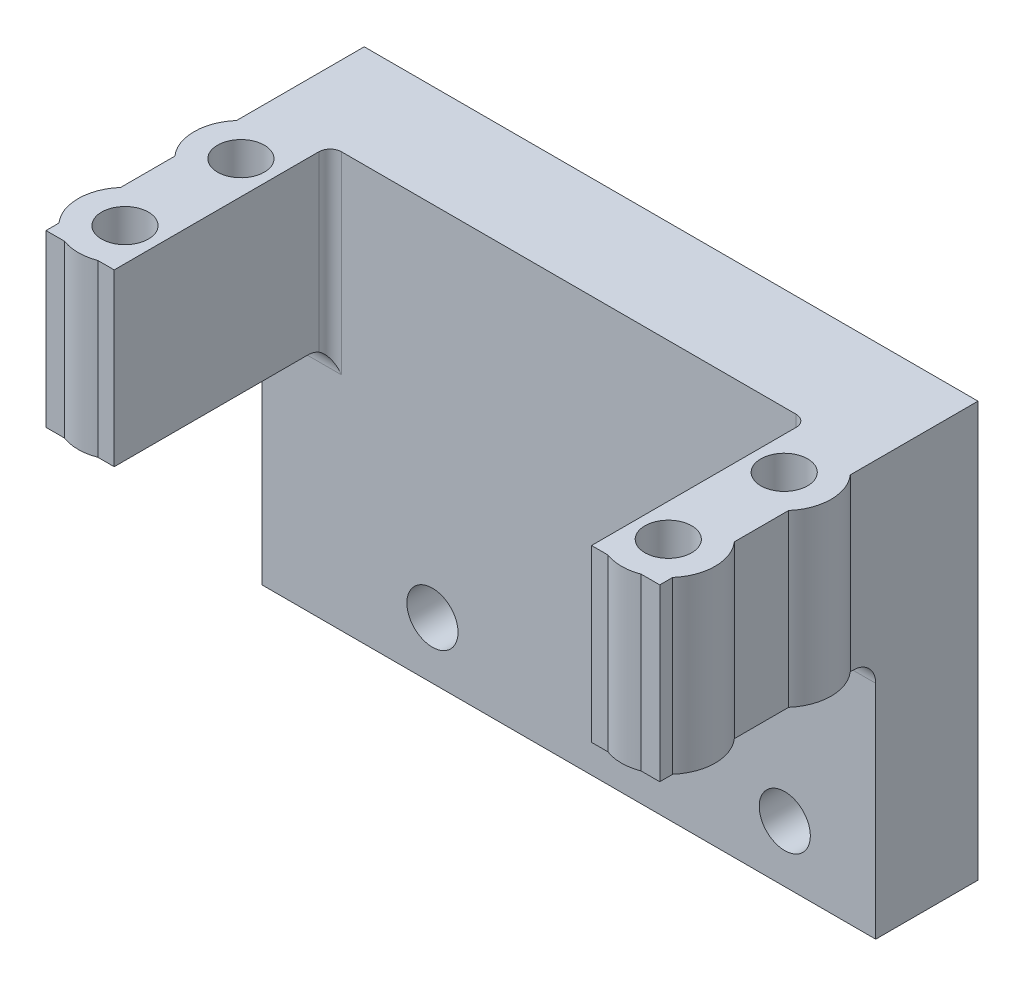
ISO-10303-21;
HEADER;
FILE_DESCRIPTION(('STEP AP214'),'2;1');
FILE_NAME('part.step','',(''),(''),'','','');
FILE_SCHEMA(('AUTOMOTIVE_DESIGN { 1 0 10303 214 1 1 1 1 }'));
ENDSEC;
DATA;
#1=APPLICATION_CONTEXT('core data for automotive mechanical design processes');
#2=APPLICATION_PROTOCOL_DEFINITION('international standard','automotive_design',2000,#1);
#3=PRODUCT_CONTEXT('',#1,'mechanical');
#4=PRODUCT('Part','Part','',(#3));
#5=PRODUCT_RELATED_PRODUCT_CATEGORY('part','',(#4));
#6=PRODUCT_DEFINITION_FORMATION('','',#4);
#7=PRODUCT_DEFINITION_CONTEXT('part definition',#1,'design');
#8=PRODUCT_DEFINITION('design','',#6,#7);
#9=PRODUCT_DEFINITION_SHAPE('','',#8);
#10=(LENGTH_UNIT() NAMED_UNIT(*) SI_UNIT(.MILLI.,.METRE.));
#11=(NAMED_UNIT(*) PLANE_ANGLE_UNIT() SI_UNIT($,.RADIAN.));
#12=(NAMED_UNIT(*) SI_UNIT($,.STERADIAN.) SOLID_ANGLE_UNIT());
#13=UNCERTAINTY_MEASURE_WITH_UNIT(LENGTH_MEASURE(1.E-05),#10,'distance_accuracy_value','');
#14=(GEOMETRIC_REPRESENTATION_CONTEXT(3) GLOBAL_UNCERTAINTY_ASSIGNED_CONTEXT((#13)) GLOBAL_UNIT_ASSIGNED_CONTEXT((#10,
#11,#12)) REPRESENTATION_CONTEXT('',''));
#15=CARTESIAN_POINT('',(0.,0.,0.));
#16=DIRECTION('',(0.,0.,1.));
#17=DIRECTION('',(1.,0.,0.));
#18=AXIS2_PLACEMENT_3D('',#15,#16,#17);
#19=CARTESIAN_POINT('',(-27.,13.25,9.));
#20=DIRECTION('',(1.,0.,0.));
#21=DIRECTION('',(0.,1.,0.));
#22=AXIS2_PLACEMENT_3D('',#19,#20,#21);
#23=PLANE('',#22);
#24=DIRECTION('',(0.,1.,0.));
#25=VECTOR('',#24,1.);
#26=CARTESIAN_POINT('',(-27.,-1.75000000000001,11.2357121559704));
#27=LINE('',#26,#25);
#28=CARTESIAN_POINT('',(-27.,13.25,11.2357121559704));
#29=VERTEX_POINT('',#28);
#30=CARTESIAN_POINT('',(-27.,-1.75000000000001,11.2357121559704));
#31=VERTEX_POINT('',#30);
#32=EDGE_CURVE('E227',#29,#31,#27,.F.);
#33=ORIENTED_EDGE('',*,*,#32,.F.);
#34=DIRECTION('',(0.,0.,-1.));
#35=VECTOR('',#34,1.);
#36=CARTESIAN_POINT('',(-27.,13.25,9.));
#37=LINE('',#36,#35);
#38=CARTESIAN_POINT('',(-27.,13.25,0.));
#39=VERTEX_POINT('',#38);
#40=EDGE_CURVE('E217',#29,#39,#37,.T.);
#41=ORIENTED_EDGE('',*,*,#40,.T.);
#42=DIRECTION('',(0.,-1.,0.));
#43=VECTOR('',#42,1.);
#44=CARTESIAN_POINT('',(-27.,13.25,0.));
#45=LINE('',#44,#43);
#46=CARTESIAN_POINT('',(-27.,-23.25,0.));
#47=VERTEX_POINT('',#46);
#48=EDGE_CURVE('E352',#39,#47,#45,.T.);
#49=ORIENTED_EDGE('',*,*,#48,.T.);
#50=DIRECTION('',(0.,0.,1.));
#51=VECTOR('',#50,1.);
#52=CARTESIAN_POINT('',(-27.,-23.25,0.));
#53=LINE('',#52,#51);
#54=CARTESIAN_POINT('',(-27.,-23.25,9.));
#55=VERTEX_POINT('',#54);
#56=EDGE_CURVE('E291',#47,#55,#53,.T.);
#57=ORIENTED_EDGE('',*,*,#56,.T.);
#58=DIRECTION('',(0.,-1.,0.));
#59=VECTOR('',#58,1.);
#60=CARTESIAN_POINT('',(-27.,13.25,9.));
#61=LINE('',#60,#59);
#62=CARTESIAN_POINT('',(-27.,-3.75000000000001,9.));
#63=VERTEX_POINT('',#62);
#64=EDGE_CURVE('E353',#63,#55,#61,.T.);
#65=ORIENTED_EDGE('',*,*,#64,.F.);
#66=CARTESIAN_POINT('',(-27.,-3.75000000000001,11.));
#67=DIRECTION('',(1.,0.,0.));
#68=DIRECTION('',(0.,1.,0.));
#69=AXIS2_PLACEMENT_3D('',#66,#67,#68);
#70=CIRCLE('',#69,2.);
#71=CARTESIAN_POINT('',(-27.,-1.75000000000001,11.));
#72=VERTEX_POINT('',#71);
#73=EDGE_CURVE('E405',#63,#72,#70,.T.);
#74=ORIENTED_EDGE('',*,*,#73,.T.);
#75=DIRECTION('',(0.,0.,-1.));
#76=VECTOR('',#75,1.);
#77=CARTESIAN_POINT('',(-27.,-1.75000000000001,28.));
#78=LINE('',#77,#76);
#79=EDGE_CURVE('E276',#31,#72,#78,.T.);
#80=ORIENTED_EDGE('',*,*,#79,.F.);
#81=EDGE_LOOP('',(#33,#41,#49,#57,#65,#74,#80));
#82=FACE_BOUND('',#81,.T.);
#83=ADVANCED_FACE('F32',(#82),#23,.F.);
#84=DIRECTION('',(0.,1.,0.));
#85=VECTOR('',#84,1.);
#86=CARTESIAN_POINT('',(-27.,-1.75000000000001,16.6631977616629));
#87=LINE('',#86,#85);
#88=CARTESIAN_POINT('',(-27.,-1.75000000000001,16.6631977616629));
#89=VERTEX_POINT('',#88);
#90=CARTESIAN_POINT('',(-27.,13.25,16.6631977616629));
#91=VERTEX_POINT('',#90);
#92=EDGE_CURVE('E209',#89,#91,#87,.T.);
#93=ORIENTED_EDGE('',*,*,#92,.F.);
#94=CARTESIAN_POINT('',(-27.,-1.75000000000001,21.4357121559704));
#95=VERTEX_POINT('',#94);
#96=EDGE_CURVE('E281',#95,#89,#78,.T.);
#97=ORIENTED_EDGE('',*,*,#96,.F.);
#98=DIRECTION('',(0.,1.,0.));
#99=VECTOR('',#98,1.);
#100=CARTESIAN_POINT('',(-27.,-1.75000000000001,21.4357121559704));
#101=LINE('',#100,#99);
#102=CARTESIAN_POINT('',(-27.,13.25,21.4357121559704));
#103=VERTEX_POINT('',#102);
#104=EDGE_CURVE('E212',#103,#95,#101,.F.);
#105=ORIENTED_EDGE('',*,*,#104,.F.);
#106=EDGE_CURVE('E206',#103,#91,#37,.T.);
#107=ORIENTED_EDGE('',*,*,#106,.T.);
#108=EDGE_LOOP('',(#93,#97,#105,#107));
#109=FACE_BOUND('',#108,.T.);
#110=ADVANCED_FACE('F208',(#109),#23,.F.);
#111=DIRECTION('',(0.,1.,0.));
#112=VECTOR('',#111,1.);
#113=CARTESIAN_POINT('',(-27.,-1.75000000000001,26.8631977616629));
#114=LINE('',#113,#112);
#115=CARTESIAN_POINT('',(-27.,-1.75000000000001,26.8631977616629));
#116=VERTEX_POINT('',#115);
#117=CARTESIAN_POINT('',(-27.,13.25,26.8631977616629));
#118=VERTEX_POINT('',#117);
#119=EDGE_CURVE('E245',#116,#118,#114,.T.);
#120=ORIENTED_EDGE('',*,*,#119,.F.);
#121=CARTESIAN_POINT('',(-27.,-1.75000000000001,28.));
#122=VERTEX_POINT('',#121);
#123=EDGE_CURVE('E277',#122,#116,#78,.T.);
#124=ORIENTED_EDGE('',*,*,#123,.F.);
#125=DIRECTION('',(0.,1.,0.));
#126=VECTOR('',#125,1.);
#127=CARTESIAN_POINT('',(-27.,13.25,28.));
#128=LINE('',#127,#126);
#129=CARTESIAN_POINT('',(-27.,13.25,28.));
#130=VERTEX_POINT('',#129);
#131=EDGE_CURVE('E256',#122,#130,#128,.T.);
#132=ORIENTED_EDGE('',*,*,#131,.T.);
#133=EDGE_CURVE('E216',#130,#118,#37,.T.);
#134=ORIENTED_EDGE('',*,*,#133,.T.);
#135=EDGE_LOOP('',(#120,#124,#132,#134));
#136=FACE_BOUND('',#135,.T.);
#137=ADVANCED_FACE('F484',(#136),#23,.F.);
#138=CARTESIAN_POINT('',(0.,0.,28.));
#139=DIRECTION('',(0.,0.,-1.));
#140=DIRECTION('',(1.,0.,0.));
#141=AXIS2_PLACEMENT_3D('',#138,#139,#140);
#142=PLANE('',#141);
#143=DIRECTION('',(0.,1.,0.));
#144=VECTOR('',#143,1.);
#145=CARTESIAN_POINT('',(-25.3655043110883,-1.75000000000001,28.));
#146=LINE('',#145,#144);
#147=CARTESIAN_POINT('',(-25.3655043110883,13.25,28.));
#148=VERTEX_POINT('',#147);
#149=CARTESIAN_POINT('',(-25.3655043110883,-1.75000000000001,28.));
#150=VERTEX_POINT('',#149);
#151=EDGE_CURVE('E392',#148,#150,#146,.F.);
#152=ORIENTED_EDGE('',*,*,#151,.F.);
#153=DIRECTION('',(1.,0.,0.));
#154=VECTOR('',#153,1.);
#155=CARTESIAN_POINT('',(-27.,13.25,28.));
#156=LINE('',#155,#154);
#157=EDGE_CURVE('E268',#130,#148,#156,.T.);
#158=ORIENTED_EDGE('',*,*,#157,.F.);
#159=ORIENTED_EDGE('',*,*,#131,.F.);
#160=DIRECTION('',(-1.,0.,0.));
#161=VECTOR('',#160,1.);
#162=CARTESIAN_POINT('',(-27.,-1.75000000000001,28.));
#163=LINE('',#162,#161);
#164=EDGE_CURVE('E259',#150,#122,#163,.T.);
#165=ORIENTED_EDGE('',*,*,#164,.F.);
#166=EDGE_LOOP('',(#152,#158,#159,#165));
#167=FACE_BOUND('',#166,.T.);
#168=ADVANCED_FACE('F480',(#167),#142,.F.);
#169=DIRECTION('',(0.,1.,0.));
#170=VECTOR('',#169,1.);
#171=CARTESIAN_POINT('',(-22.4344956889117,-1.75000000000001,28.));
#172=LINE('',#171,#170);
#173=CARTESIAN_POINT('',(-22.4344956889117,-1.75000000000001,28.));
#174=VERTEX_POINT('',#173);
#175=CARTESIAN_POINT('',(-22.4344956889117,13.25,28.));
#176=VERTEX_POINT('',#175);
#177=EDGE_CURVE('E381',#174,#176,#172,.T.);
#178=ORIENTED_EDGE('',*,*,#177,.F.);
#179=CARTESIAN_POINT('',(-21.,-1.75000000000001,28.));
#180=VERTEX_POINT('',#179);
#181=EDGE_CURVE('E261',#180,#174,#163,.T.);
#182=ORIENTED_EDGE('',*,*,#181,.F.);
#183=DIRECTION('',(0.,-1.,0.));
#184=VECTOR('',#183,1.);
#185=CARTESIAN_POINT('',(-21.,13.25,28.));
#186=LINE('',#185,#184);
#187=CARTESIAN_POINT('',(-21.,13.25,28.));
#188=VERTEX_POINT('',#187);
#189=EDGE_CURVE('E264',#188,#180,#186,.T.);
#190=ORIENTED_EDGE('',*,*,#189,.F.);
#191=EDGE_CURVE('E267',#176,#188,#156,.T.);
#192=ORIENTED_EDGE('',*,*,#191,.F.);
#193=EDGE_LOOP('',(#178,#182,#190,#192));
#194=FACE_BOUND('',#193,.T.);
#195=ADVANCED_FACE('F472',(#194),#142,.F.);
#196=CARTESIAN_POINT('',(27.,13.25,9.));
#197=DIRECTION('',(-1.,0.,0.));
#198=DIRECTION('',(0.,-1.,0.));
#199=AXIS2_PLACEMENT_3D('',#196,#197,#198);
#200=PLANE('',#199);
#201=DIRECTION('',(0.,0.,-1.));
#202=VECTOR('',#201,1.);
#203=CARTESIAN_POINT('',(27.,-1.75,28.));
#204=LINE('',#203,#202);
#205=CARTESIAN_POINT('',(27.,-1.75,21.4357121559704));
#206=VERTEX_POINT('',#205);
#207=CARTESIAN_POINT('',(27.,-1.75,16.6631977616629));
#208=VERTEX_POINT('',#207);
#209=EDGE_CURVE('E347',#206,#208,#204,.T.);
#210=ORIENTED_EDGE('',*,*,#209,.T.);
#211=DIRECTION('',(0.,1.,0.));
#212=VECTOR('',#211,1.);
#213=CARTESIAN_POINT('',(27.,-1.75,16.6631977616629));
#214=LINE('',#213,#212);
#215=CARTESIAN_POINT('',(27.,13.25,16.6631977616629));
#216=VERTEX_POINT('',#215);
#217=EDGE_CURVE('E308',#208,#216,#214,.T.);
#218=ORIENTED_EDGE('',*,*,#217,.T.);
#219=DIRECTION('',(0.,0.,-1.));
#220=VECTOR('',#219,1.);
#221=CARTESIAN_POINT('',(27.,13.25,9.));
#222=LINE('',#221,#220);
#223=CARTESIAN_POINT('',(27.,13.25,21.4357121559704));
#224=VERTEX_POINT('',#223);
#225=EDGE_CURVE('E372',#224,#216,#222,.T.);
#226=ORIENTED_EDGE('',*,*,#225,.F.);
#227=DIRECTION('',(0.,1.,0.));
#228=VECTOR('',#227,1.);
#229=CARTESIAN_POINT('',(27.,-1.75,21.4357121559704));
#230=LINE('',#229,#228);
#231=EDGE_CURVE('E317',#224,#206,#230,.F.);
#232=ORIENTED_EDGE('',*,*,#231,.T.);
#233=EDGE_LOOP('',(#210,#218,#226,#232));
#234=FACE_BOUND('',#233,.T.);
#235=ADVANCED_FACE('F512',(#234),#200,.F.);
#236=CARTESIAN_POINT('',(27.,-1.75,28.));
#237=VERTEX_POINT('',#236);
#238=CARTESIAN_POINT('',(27.,-1.75,26.8631977616629));
#239=VERTEX_POINT('',#238);
#240=EDGE_CURVE('E343',#237,#239,#204,.T.);
#241=ORIENTED_EDGE('',*,*,#240,.T.);
#242=DIRECTION('',(0.,1.,0.));
#243=VECTOR('',#242,1.);
#244=CARTESIAN_POINT('',(27.,-1.75,26.8631977616629));
#245=LINE('',#244,#243);
#246=CARTESIAN_POINT('',(27.,13.25,26.8631977616629));
#247=VERTEX_POINT('',#246);
#248=EDGE_CURVE('E320',#239,#247,#245,.T.);
#249=ORIENTED_EDGE('',*,*,#248,.T.);
#250=CARTESIAN_POINT('',(27.,13.25,28.));
#251=VERTEX_POINT('',#250);
#252=EDGE_CURVE('E368',#251,#247,#222,.T.);
#253=ORIENTED_EDGE('',*,*,#252,.F.);
#254=DIRECTION('',(0.,1.,0.));
#255=VECTOR('',#254,1.);
#256=CARTESIAN_POINT('',(27.,13.25,28.));
#257=LINE('',#256,#255);
#258=EDGE_CURVE('E330',#237,#251,#257,.T.);
#259=ORIENTED_EDGE('',*,*,#258,.F.);
#260=EDGE_LOOP('',(#241,#249,#253,#259));
#261=FACE_BOUND('',#260,.T.);
#262=ADVANCED_FACE('F524',(#261),#200,.F.);
#263=CARTESIAN_POINT('',(0.,0.,28.));
#264=DIRECTION('',(0.,0.,-1.));
#265=DIRECTION('',(-1.,0.,0.));
#266=AXIS2_PLACEMENT_3D('',#263,#264,#265);
#267=PLANE('',#266);
#268=DIRECTION('',(1.,0.,0.));
#269=VECTOR('',#268,1.);
#270=CARTESIAN_POINT('',(27.,-1.75,28.));
#271=LINE('',#270,#269);
#272=CARTESIAN_POINT('',(21.,-1.75,28.));
#273=VERTEX_POINT('',#272);
#274=CARTESIAN_POINT('',(22.4344956889117,-1.75,28.));
#275=VERTEX_POINT('',#274);
#276=EDGE_CURVE('E340',#273,#275,#271,.T.);
#277=ORIENTED_EDGE('',*,*,#276,.T.);
#278=DIRECTION('',(0.,1.,0.));
#279=VECTOR('',#278,1.);
#280=CARTESIAN_POINT('',(22.4344956889117,-1.75,28.));
#281=LINE('',#280,#279);
#282=CARTESIAN_POINT('',(22.4344956889117,13.25,28.));
#283=VERTEX_POINT('',#282);
#284=EDGE_CURVE('E378',#275,#283,#281,.T.);
#285=ORIENTED_EDGE('',*,*,#284,.T.);
#286=DIRECTION('',(-1.,0.,0.));
#287=VECTOR('',#286,1.);
#288=CARTESIAN_POINT('',(27.,13.25,28.));
#289=LINE('',#288,#287);
#290=CARTESIAN_POINT('',(21.,13.25,28.));
#291=VERTEX_POINT('',#290);
#292=EDGE_CURVE('E333',#283,#291,#289,.T.);
#293=ORIENTED_EDGE('',*,*,#292,.T.);
#294=DIRECTION('',(0.,-1.,0.));
#295=VECTOR('',#294,1.);
#296=CARTESIAN_POINT('',(21.,13.25,28.));
#297=LINE('',#296,#295);
#298=EDGE_CURVE('E337',#291,#273,#297,.T.);
#299=ORIENTED_EDGE('',*,*,#298,.T.);
#300=EDGE_LOOP('',(#277,#285,#293,#299));
#301=FACE_BOUND('',#300,.T.);
#302=ADVANCED_FACE('F537',(#301),#267,.F.);
#303=CARTESIAN_POINT('',(27.,-1.75,11.2357121559704));
#304=VERTEX_POINT('',#303);
#305=CARTESIAN_POINT('',(27.,-1.75,11.));
#306=VERTEX_POINT('',#305);
#307=EDGE_CURVE('E342',#304,#306,#204,.T.);
#308=ORIENTED_EDGE('',*,*,#307,.T.);
#309=CARTESIAN_POINT('',(27.,-3.75,11.));
#310=DIRECTION('',(-1.,0.,0.));
#311=DIRECTION('',(0.,-1.,0.));
#312=AXIS2_PLACEMENT_3D('',#309,#310,#311);
#313=CIRCLE('',#312,2.);
#314=CARTESIAN_POINT('',(27.,-3.75,9.));
#315=VERTEX_POINT('',#314);
#316=EDGE_CURVE('E410',#306,#315,#313,.T.);
#317=ORIENTED_EDGE('',*,*,#316,.T.);
#318=DIRECTION('',(0.,1.,0.));
#319=VECTOR('',#318,1.);
#320=CARTESIAN_POINT('',(27.,13.25,9.));
#321=LINE('',#320,#319);
#322=CARTESIAN_POINT('',(27.,-23.25,9.));
#323=VERTEX_POINT('',#322);
#324=EDGE_CURVE('E355',#323,#315,#321,.T.);
#325=ORIENTED_EDGE('',*,*,#324,.F.);
#326=DIRECTION('',(0.,0.,1.));
#327=VECTOR('',#326,1.);
#328=CARTESIAN_POINT('',(27.,-23.25,0.));
#329=LINE('',#328,#327);
#330=CARTESIAN_POINT('',(27.,-23.25,0.));
#331=VERTEX_POINT('',#330);
#332=EDGE_CURVE('E296',#331,#323,#329,.T.);
#333=ORIENTED_EDGE('',*,*,#332,.F.);
#334=DIRECTION('',(0.,1.,0.));
#335=VECTOR('',#334,1.);
#336=CARTESIAN_POINT('',(27.,13.25,0.));
#337=LINE('',#336,#335);
#338=CARTESIAN_POINT('',(27.,13.25,0.));
#339=VERTEX_POINT('',#338);
#340=EDGE_CURVE('E363',#331,#339,#337,.T.);
#341=ORIENTED_EDGE('',*,*,#340,.T.);
#342=CARTESIAN_POINT('',(27.,13.25,11.2357121559704));
#343=VERTEX_POINT('',#342);
#344=EDGE_CURVE('E367',#343,#339,#222,.T.);
#345=ORIENTED_EDGE('',*,*,#344,.F.);
#346=DIRECTION('',(0.,1.,0.));
#347=VECTOR('',#346,1.);
#348=CARTESIAN_POINT('',(27.,-1.75,11.2357121559704));
#349=LINE('',#348,#347);
#350=EDGE_CURVE('E304',#343,#304,#349,.F.);
#351=ORIENTED_EDGE('',*,*,#350,.T.);
#352=EDGE_LOOP('',(#308,#317,#325,#333,#341,#345,#351));
#353=FACE_BOUND('',#352,.T.);
#354=ADVANCED_FACE('F506',(#353),#200,.F.);
#355=CARTESIAN_POINT('',(-27.,13.25,9.));
#356=DIRECTION('',(0.,-1.,0.));
#357=DIRECTION('',(1.,0.,0.));
#358=AXIS2_PLACEMENT_3D('',#355,#356,#357);
#359=PLANE('',#358);
#360=DIRECTION('',(0.,0.,-1.));
#361=VECTOR('',#360,1.);
#362=CARTESIAN_POINT('',(-21.,13.25,28.));
#363=LINE('',#362,#361);
#364=CARTESIAN_POINT('',(-21.,13.25,10.));
#365=VERTEX_POINT('',#364);
#366=EDGE_CURVE('E271',#188,#365,#363,.T.);
#367=ORIENTED_EDGE('',*,*,#366,.T.);
#368=CARTESIAN_POINT('',(-20.,13.25,10.));
#369=DIRECTION('',(0.,-1.,0.));
#370=DIRECTION('',(1.,0.,0.));
#371=AXIS2_PLACEMENT_3D('',#368,#369,#370);
#372=CIRCLE('',#371,1.);
#373=CARTESIAN_POINT('',(-20.,13.25,9.));
#374=VERTEX_POINT('',#373);
#375=EDGE_CURVE('E430',#365,#374,#372,.T.);
#376=ORIENTED_EDGE('',*,*,#375,.T.);
#377=DIRECTION('',(-1.,0.,0.));
#378=VECTOR('',#377,1.);
#379=CARTESIAN_POINT('',(-27.,13.25,9.));
#380=LINE('',#379,#378);
#381=CARTESIAN_POINT('',(20.,13.25,9.));
#382=VERTEX_POINT('',#381);
#383=EDGE_CURVE('E359',#382,#374,#380,.T.);
#384=ORIENTED_EDGE('',*,*,#383,.F.);
#385=CARTESIAN_POINT('',(20.,13.25,10.));
#386=DIRECTION('',(0.,-1.,0.));
#387=DIRECTION('',(1.,0.,0.));
#388=AXIS2_PLACEMENT_3D('',#385,#386,#387);
#389=CIRCLE('',#388,1.);
#390=CARTESIAN_POINT('',(21.,13.25,10.));
#391=VERTEX_POINT('',#390);
#392=EDGE_CURVE('E11',#382,#391,#389,.T.);
#393=ORIENTED_EDGE('',*,*,#392,.T.);
#394=DIRECTION('',(0.,0.,-1.));
#395=VECTOR('',#394,1.);
#396=CARTESIAN_POINT('',(21.,13.25,28.));
#397=LINE('',#396,#395);
#398=EDGE_CURVE('E350',#291,#391,#397,.T.);
#399=ORIENTED_EDGE('',*,*,#398,.F.);
#400=ORIENTED_EDGE('',*,*,#292,.F.);
#401=CARTESIAN_POINT('',(23.9,13.25,24.1494549588167));
#402=DIRECTION('',(0.,1.,0.));
#403=DIRECTION('',(-1.,0.,0.));
#404=AXIS2_PLACEMENT_3D('',#401,#402,#403);
#405=CIRCLE('',#404,4.12);
#406=CARTESIAN_POINT('',(25.3655043110883,13.25,28.));
#407=VERTEX_POINT('',#406);
#408=EDGE_CURVE('E315',#283,#407,#405,.T.);
#409=ORIENTED_EDGE('',*,*,#408,.T.);
#410=EDGE_CURVE('E335',#251,#407,#289,.T.);
#411=ORIENTED_EDGE('',*,*,#410,.F.);
#412=ORIENTED_EDGE('',*,*,#252,.T.);
#413=EDGE_CURVE('E311',#247,#224,#405,.T.);
#414=ORIENTED_EDGE('',*,*,#413,.T.);
#415=ORIENTED_EDGE('',*,*,#225,.T.);
#416=CARTESIAN_POINT('',(23.9,13.25,13.9494549588167));
#417=DIRECTION('',(0.,1.,0.));
#418=DIRECTION('',(-1.,0.,0.));
#419=AXIS2_PLACEMENT_3D('',#416,#417,#418);
#420=CIRCLE('',#419,4.12);
#421=EDGE_CURVE('E299',#216,#343,#420,.T.);
#422=ORIENTED_EDGE('',*,*,#421,.T.);
#423=ORIENTED_EDGE('',*,*,#344,.T.);
#424=DIRECTION('',(-1.,0.,0.));
#425=VECTOR('',#424,1.);
#426=CARTESIAN_POINT('',(-27.,13.25,0.));
#427=LINE('',#426,#425);
#428=EDGE_CURVE('E356',#339,#39,#427,.T.);
#429=ORIENTED_EDGE('',*,*,#428,.T.);
#430=ORIENTED_EDGE('',*,*,#40,.F.);
#431=CARTESIAN_POINT('',(-23.9,13.25,13.9494549588167));
#432=DIRECTION('',(0.,-1.,0.));
#433=DIRECTION('',(1.,0.,0.));
#434=AXIS2_PLACEMENT_3D('',#431,#432,#433);
#435=CIRCLE('',#434,4.12);
#436=EDGE_CURVE('E224',#91,#29,#435,.T.);
#437=ORIENTED_EDGE('',*,*,#436,.F.);
#438=ORIENTED_EDGE('',*,*,#106,.F.);
#439=CARTESIAN_POINT('',(-23.9,13.25,24.1494549588167));
#440=DIRECTION('',(0.,-1.,0.));
#441=DIRECTION('',(1.,0.,0.));
#442=AXIS2_PLACEMENT_3D('',#439,#440,#441);
#443=CIRCLE('',#442,4.12);
#444=EDGE_CURVE('E238',#118,#103,#443,.T.);
#445=ORIENTED_EDGE('',*,*,#444,.F.);
#446=ORIENTED_EDGE('',*,*,#133,.F.);
#447=ORIENTED_EDGE('',*,*,#157,.T.);
#448=EDGE_CURVE('E243',#176,#148,#443,.T.);
#449=ORIENTED_EDGE('',*,*,#448,.F.);
#450=ORIENTED_EDGE('',*,*,#191,.T.);
#451=EDGE_LOOP('',(#367,#376,#384,#393,#399,#400,#409,#411,#412,#414,#415,#422,#423,#429,#430,
#437,#438,#445,#446,#447,#449,#450));
#452=FACE_BOUND('',#451,.T.);
#453=CARTESIAN_POINT('',(-23.9,13.25,13.9494549588167));
#454=DIRECTION('',(0.,-1.,0.));
#455=DIRECTION('',(1.,0.,0.));
#456=AXIS2_PLACEMENT_3D('',#453,#454,#455);
#457=CIRCLE('',#456,2.06);
#458=CARTESIAN_POINT('',(-21.84,13.25,13.9494549588167));
#459=VERTEX_POINT('',#458);
#460=EDGE_CURVE('E250',#459,#459,#457,.T.);
#461=ORIENTED_EDGE('',*,*,#460,.T.);
#462=EDGE_LOOP('',(#461));
#463=FACE_BOUND('',#462,.T.);
#464=CARTESIAN_POINT('',(-23.9,13.25,24.1494549588167));
#465=DIRECTION('',(0.,-1.,0.));
#466=DIRECTION('',(1.,0.,0.));
#467=AXIS2_PLACEMENT_3D('',#464,#465,#466);
#468=CIRCLE('',#467,2.06);
#469=CARTESIAN_POINT('',(-21.84,13.25,24.1494549588167));
#470=VERTEX_POINT('',#469);
#471=EDGE_CURVE('E249',#470,#470,#468,.T.);
#472=ORIENTED_EDGE('',*,*,#471,.T.);
#473=EDGE_LOOP('',(#472));
#474=FACE_BOUND('',#473,.T.);
#475=CARTESIAN_POINT('',(23.9,13.25,13.9494549588167));
#476=DIRECTION('',(0.,1.,0.));
#477=DIRECTION('',(-1.,0.,0.));
#478=AXIS2_PLACEMENT_3D('',#475,#476,#477);
#479=CIRCLE('',#478,2.06);
#480=CARTESIAN_POINT('',(21.84,13.25,13.9494549588167));
#481=VERTEX_POINT('',#480);
#482=EDGE_CURVE('E324',#481,#481,#479,.T.);
#483=ORIENTED_EDGE('',*,*,#482,.F.);
#484=EDGE_LOOP('',(#483));
#485=FACE_BOUND('',#484,.T.);
#486=CARTESIAN_POINT('',(23.9,13.25,24.1494549588167));
#487=DIRECTION('',(0.,1.,0.));
#488=DIRECTION('',(-1.,0.,0.));
#489=AXIS2_PLACEMENT_3D('',#486,#487,#488);
#490=CIRCLE('',#489,2.06);
#491=CARTESIAN_POINT('',(21.84,13.25,24.1494549588167));
#492=VERTEX_POINT('',#491);
#493=EDGE_CURVE('E323',#492,#492,#490,.T.);
#494=ORIENTED_EDGE('',*,*,#493,.F.);
#495=EDGE_LOOP('',(#494));
#496=FACE_BOUND('',#495,.T.);
#497=ADVANCED_FACE('F231',(#452,#463,#474,#485,#496),#359,.F.);
#498=CARTESIAN_POINT('',(0.,0.,9.));
#499=DIRECTION('',(0.,0.,1.));
#500=DIRECTION('',(1.,0.,0.));
#501=AXIS2_PLACEMENT_3D('',#498,#499,#500);
#502=PLANE('',#501);
#503=ORIENTED_EDGE('',*,*,#383,.T.);
#504=DIRECTION('',(0.,-1.,0.));
#505=VECTOR('',#504,1.);
#506=CARTESIAN_POINT('',(-20.,-3.75000000000001,9.));
#507=LINE('',#506,#505);
#508=CARTESIAN_POINT('',(-20.,-3.75000000000001,9.));
#509=VERTEX_POINT('',#508);
#510=EDGE_CURVE('E416',#374,#509,#507,.T.);
#511=ORIENTED_EDGE('',*,*,#510,.T.);
#512=DIRECTION('',(-1.,0.,0.));
#513=VECTOR('',#512,1.);
#514=CARTESIAN_POINT('',(-27.,-3.75000000000001,9.));
#515=LINE('',#514,#513);
#516=EDGE_CURVE('E397',#509,#63,#515,.T.);
#517=ORIENTED_EDGE('',*,*,#516,.T.);
#518=ORIENTED_EDGE('',*,*,#64,.T.);
#519=DIRECTION('',(1.,0.,0.));
#520=VECTOR('',#519,1.);
#521=CARTESIAN_POINT('',(-27.,-23.25,9.));
#522=LINE('',#521,#520);
#523=EDGE_CURVE('E292',#55,#323,#522,.T.);
#524=ORIENTED_EDGE('',*,*,#523,.T.);
#525=ORIENTED_EDGE('',*,*,#324,.T.);
#526=DIRECTION('',(1.,0.,0.));
#527=VECTOR('',#526,1.);
#528=CARTESIAN_POINT('',(0.,-3.75000000000001,9.));
#529=LINE('',#528,#527);
#530=CARTESIAN_POINT('',(20.,-3.75,9.));
#531=VERTEX_POINT('',#530);
#532=EDGE_CURVE('E395',#315,#531,#529,.F.);
#533=ORIENTED_EDGE('',*,*,#532,.T.);
#534=DIRECTION('',(0.,-1.,0.));
#535=VECTOR('',#534,1.);
#536=CARTESIAN_POINT('',(20.,0.,9.));
#537=LINE('',#536,#535);
#538=EDGE_CURVE('E414',#531,#382,#537,.F.);
#539=ORIENTED_EDGE('',*,*,#538,.T.);
#540=EDGE_LOOP('',(#503,#511,#517,#518,#524,#525,#533,#539));
#541=FACE_BOUND('',#540,.T.);
#542=CARTESIAN_POINT('',(19.,-18.25,9.));
#543=DIRECTION('',(0.,0.,1.));
#544=DIRECTION('',(1.,0.,0.));
#545=AXIS2_PLACEMENT_3D('',#542,#543,#544);
#546=CIRCLE('',#545,2.25);
#547=CARTESIAN_POINT('',(21.25,-18.25,9.));
#548=VERTEX_POINT('',#547);
#549=EDGE_CURVE('E282',#548,#548,#546,.T.);
#550=ORIENTED_EDGE('',*,*,#549,.F.);
#551=EDGE_LOOP('',(#550));
#552=FACE_BOUND('',#551,.T.);
#553=CARTESIAN_POINT('',(-12.,-18.25,9.));
#554=DIRECTION('',(0.,0.,1.));
#555=DIRECTION('',(1.,0.,0.));
#556=AXIS2_PLACEMENT_3D('',#553,#554,#555);
#557=CIRCLE('',#556,2.25);
#558=CARTESIAN_POINT('',(-9.75,-18.25,9.));
#559=VERTEX_POINT('',#558);
#560=EDGE_CURVE('E280',#559,#559,#557,.T.);
#561=ORIENTED_EDGE('',*,*,#560,.F.);
#562=EDGE_LOOP('',(#561));
#563=FACE_BOUND('',#562,.T.);
#564=ADVANCED_FACE('F456',(#541,#552,#563),#502,.T.);
#565=CARTESIAN_POINT('',(0.,0.,0.));
#566=DIRECTION('',(0.,0.,1.));
#567=DIRECTION('',(1.,0.,0.));
#568=AXIS2_PLACEMENT_3D('',#565,#566,#567);
#569=PLANE('',#568);
#570=CARTESIAN_POINT('',(19.,-18.25,0.));
#571=DIRECTION('',(0.,0.,1.));
#572=DIRECTION('',(1.,0.,0.));
#573=AXIS2_PLACEMENT_3D('',#570,#571,#572);
#574=CIRCLE('',#573,2.25);
#575=CARTESIAN_POINT('',(21.25,-18.25,0.));
#576=VERTEX_POINT('',#575);
#577=EDGE_CURVE('E295',#576,#576,#574,.T.);
#578=ORIENTED_EDGE('',*,*,#577,.T.);
#579=EDGE_LOOP('',(#578));
#580=FACE_BOUND('',#579,.T.);
#581=CARTESIAN_POINT('',(-12.,-18.25,0.));
#582=DIRECTION('',(0.,0.,1.));
#583=DIRECTION('',(1.,0.,0.));
#584=AXIS2_PLACEMENT_3D('',#581,#582,#583);
#585=CIRCLE('',#584,2.25);
#586=CARTESIAN_POINT('',(-9.75,-18.25,0.));
#587=VERTEX_POINT('',#586);
#588=EDGE_CURVE('E285',#587,#587,#585,.T.);
#589=ORIENTED_EDGE('',*,*,#588,.T.);
#590=EDGE_LOOP('',(#589));
#591=FACE_BOUND('',#590,.T.);
#592=DIRECTION('',(1.,0.,0.));
#593=VECTOR('',#592,1.);
#594=CARTESIAN_POINT('',(-27.,-23.25,0.));
#595=LINE('',#594,#593);
#596=EDGE_CURVE('E288',#47,#331,#595,.T.);
#597=ORIENTED_EDGE('',*,*,#596,.F.);
#598=ORIENTED_EDGE('',*,*,#48,.F.);
#599=ORIENTED_EDGE('',*,*,#428,.F.);
#600=ORIENTED_EDGE('',*,*,#340,.F.);
#601=EDGE_LOOP('',(#597,#598,#599,#600));
#602=FACE_BOUND('',#601,.T.);
#603=ADVANCED_FACE('F594',(#580,#591,#602),#569,.F.);
#604=CARTESIAN_POINT('',(21.,13.25,28.));
#605=DIRECTION('',(1.,0.,0.));
#606=DIRECTION('',(0.,0.,-1.));
#607=AXIS2_PLACEMENT_3D('',#604,#605,#606);
#608=PLANE('',#607);
#609=ORIENTED_EDGE('',*,*,#398,.T.);
#610=DIRECTION('',(0.,-1.,0.));
#611=VECTOR('',#610,1.);
#612=CARTESIAN_POINT('',(21.,13.25,10.));
#613=LINE('',#612,#611);
#614=CARTESIAN_POINT('',(21.,-2.01794919243113,10.));
#615=VERTEX_POINT('',#614);
#616=EDGE_CURVE('E421',#391,#615,#613,.T.);
#617=ORIENTED_EDGE('',*,*,#616,.T.);
#618=CARTESIAN_POINT('',(21.,-3.75,11.));
#619=DIRECTION('',(1.,0.,0.));
#620=DIRECTION('',(0.,0.,-1.));
#621=AXIS2_PLACEMENT_3D('',#618,#619,#620);
#622=CIRCLE('',#621,2.);
#623=CARTESIAN_POINT('',(21.,-1.75,11.));
#624=VERTEX_POINT('',#623);
#625=EDGE_CURVE('E412',#615,#624,#622,.T.);
#626=ORIENTED_EDGE('',*,*,#625,.T.);
#627=DIRECTION('',(0.,0.,-1.));
#628=VECTOR('',#627,1.);
#629=CARTESIAN_POINT('',(21.,-1.75,28.));
#630=LINE('',#629,#628);
#631=EDGE_CURVE('E346',#273,#624,#630,.T.);
#632=ORIENTED_EDGE('',*,*,#631,.F.);
#633=ORIENTED_EDGE('',*,*,#298,.F.);
#634=EDGE_LOOP('',(#609,#617,#626,#632,#633));
#635=FACE_BOUND('',#634,.T.);
#636=ADVANCED_FACE('F540',(#635),#608,.F.);
#637=CARTESIAN_POINT('',(27.,-1.75,28.));
#638=DIRECTION('',(0.,1.,0.));
#639=DIRECTION('',(-1.,0.,0.));
#640=AXIS2_PLACEMENT_3D('',#637,#638,#639);
#641=PLANE('',#640);
#642=ORIENTED_EDGE('',*,*,#631,.T.);
#643=DIRECTION('',(1.,0.,0.));
#644=VECTOR('',#643,1.);
#645=CARTESIAN_POINT('',(27.,-1.75,11.));
#646=LINE('',#645,#644);
#647=EDGE_CURVE('E402',#624,#306,#646,.T.);
#648=ORIENTED_EDGE('',*,*,#647,.T.);
#649=ORIENTED_EDGE('',*,*,#307,.F.);
#650=CARTESIAN_POINT('',(23.9,-1.75,13.9494549588167));
#651=DIRECTION('',(0.,1.,0.));
#652=DIRECTION('',(-1.,0.,0.));
#653=AXIS2_PLACEMENT_3D('',#650,#651,#652);
#654=CIRCLE('',#653,4.12);
#655=EDGE_CURVE('E302',#208,#304,#654,.T.);
#656=ORIENTED_EDGE('',*,*,#655,.F.);
#657=ORIENTED_EDGE('',*,*,#209,.F.);
#658=CARTESIAN_POINT('',(23.9,-1.75,24.1494549588167));
#659=DIRECTION('',(0.,1.,0.));
#660=DIRECTION('',(-1.,0.,0.));
#661=AXIS2_PLACEMENT_3D('',#658,#659,#660);
#662=CIRCLE('',#661,4.12);
#663=EDGE_CURVE('E312',#239,#206,#662,.T.);
#664=ORIENTED_EDGE('',*,*,#663,.F.);
#665=ORIENTED_EDGE('',*,*,#240,.F.);
#666=CARTESIAN_POINT('',(25.3655043110883,-1.75,28.));
#667=VERTEX_POINT('',#666);
#668=EDGE_CURVE('E339',#667,#237,#271,.T.);
#669=ORIENTED_EDGE('',*,*,#668,.F.);
#670=EDGE_CURVE('E314',#275,#667,#662,.T.);
#671=ORIENTED_EDGE('',*,*,#670,.F.);
#672=ORIENTED_EDGE('',*,*,#276,.F.);
#673=EDGE_LOOP('',(#642,#648,#649,#656,#657,#664,#665,#669,#671,#672));
#674=FACE_BOUND('',#673,.T.);
#675=CARTESIAN_POINT('',(23.9,-1.75,13.9494549588167));
#676=DIRECTION('',(0.,1.,0.));
#677=DIRECTION('',(-1.,0.,0.));
#678=AXIS2_PLACEMENT_3D('',#675,#676,#677);
#679=CIRCLE('',#678,2.06);
#680=CARTESIAN_POINT('',(21.84,-1.75,13.9494549588167));
#681=VERTEX_POINT('',#680);
#682=EDGE_CURVE('E334',#681,#681,#679,.T.);
#683=ORIENTED_EDGE('',*,*,#682,.T.);
#684=EDGE_LOOP('',(#683));
#685=FACE_BOUND('',#684,.T.);
#686=CARTESIAN_POINT('',(23.9,-1.75,24.1494549588167));
#687=DIRECTION('',(0.,1.,0.));
#688=DIRECTION('',(-1.,0.,0.));
#689=AXIS2_PLACEMENT_3D('',#686,#687,#688);
#690=CIRCLE('',#689,2.06);
#691=CARTESIAN_POINT('',(21.84,-1.75,24.1494549588167));
#692=VERTEX_POINT('',#691);
#693=EDGE_CURVE('E327',#692,#692,#690,.T.);
#694=ORIENTED_EDGE('',*,*,#693,.T.);
#695=EDGE_LOOP('',(#694));
#696=FACE_BOUND('',#695,.T.);
#697=ADVANCED_FACE('F501',(#674,#685,#696),#641,.F.);
#698=ORIENTED_EDGE('',*,*,#410,.T.);
#699=DIRECTION('',(0.,1.,0.));
#700=VECTOR('',#699,1.);
#701=CARTESIAN_POINT('',(25.3655043110883,-1.75,28.));
#702=LINE('',#701,#700);
#703=EDGE_CURVE('E371',#407,#667,#702,.F.);
#704=ORIENTED_EDGE('',*,*,#703,.T.);
#705=ORIENTED_EDGE('',*,*,#668,.T.);
#706=ORIENTED_EDGE('',*,*,#258,.T.);
#707=EDGE_LOOP('',(#698,#704,#705,#706));
#708=FACE_BOUND('',#707,.T.);
#709=ADVANCED_FACE('F586',(#708),#267,.F.);
#710=CARTESIAN_POINT('',(23.9,-5.75,24.1494549588167));
#711=DIRECTION('',(0.,1.,0.));
#712=DIRECTION('',(-1.,0.,0.));
#713=AXIS2_PLACEMENT_3D('',#710,#711,#712);
#714=CYLINDRICAL_SURFACE('',#713,2.06);
#715=ORIENTED_EDGE('',*,*,#493,.T.);
#716=EDGE_LOOP('',(#715));
#717=FACE_BOUND('',#716,.T.);
#718=ORIENTED_EDGE('',*,*,#693,.F.);
#719=EDGE_LOOP('',(#718));
#720=FACE_BOUND('',#719,.T.);
#721=ADVANCED_FACE('F582',(#717,#720),#714,.F.);
#722=CARTESIAN_POINT('',(23.9,-5.75,13.9494549588167));
#723=DIRECTION('',(0.,1.,0.));
#724=DIRECTION('',(-1.,0.,0.));
#725=AXIS2_PLACEMENT_3D('',#722,#723,#724);
#726=CYLINDRICAL_SURFACE('',#725,2.06);
#727=ORIENTED_EDGE('',*,*,#482,.T.);
#728=EDGE_LOOP('',(#727));
#729=FACE_BOUND('',#728,.T.);
#730=ORIENTED_EDGE('',*,*,#682,.F.);
#731=EDGE_LOOP('',(#730));
#732=FACE_BOUND('',#731,.T.);
#733=ADVANCED_FACE('F579',(#729,#732),#726,.F.);
#734=CARTESIAN_POINT('',(23.9,-1.75,24.1494549588167));
#735=DIRECTION('',(0.,1.,0.));
#736=DIRECTION('',(-1.,0.,0.));
#737=AXIS2_PLACEMENT_3D('',#734,#735,#736);
#738=CYLINDRICAL_SURFACE('',#737,4.12);
#739=ORIENTED_EDGE('',*,*,#284,.F.);
#740=ORIENTED_EDGE('',*,*,#670,.T.);
#741=ORIENTED_EDGE('',*,*,#703,.F.);
#742=ORIENTED_EDGE('',*,*,#408,.F.);
#743=EDGE_LOOP('',(#739,#740,#741,#742));
#744=FACE_BOUND('',#743,.T.);
#745=ADVANCED_FACE('F533',(#744),#738,.T.);
#746=ORIENTED_EDGE('',*,*,#248,.F.);
#747=ORIENTED_EDGE('',*,*,#663,.T.);
#748=ORIENTED_EDGE('',*,*,#231,.F.);
#749=ORIENTED_EDGE('',*,*,#413,.F.);
#750=EDGE_LOOP('',(#746,#747,#748,#749));
#751=FACE_BOUND('',#750,.T.);
#752=ADVANCED_FACE('F522',(#751),#738,.T.);
#753=CARTESIAN_POINT('',(23.9,-1.75,13.9494549588167));
#754=DIRECTION('',(0.,1.,0.));
#755=DIRECTION('',(-1.,0.,0.));
#756=AXIS2_PLACEMENT_3D('',#753,#754,#755);
#757=CYLINDRICAL_SURFACE('',#756,4.12);
#758=ORIENTED_EDGE('',*,*,#217,.F.);
#759=ORIENTED_EDGE('',*,*,#655,.T.);
#760=ORIENTED_EDGE('',*,*,#350,.F.);
#761=ORIENTED_EDGE('',*,*,#421,.F.);
#762=EDGE_LOOP('',(#758,#759,#760,#761));
#763=FACE_BOUND('',#762,.T.);
#764=ADVANCED_FACE('F519',(#763),#757,.T.);
#765=CARTESIAN_POINT('',(-27.,-23.25,0.));
#766=DIRECTION('',(0.,-1.,0.));
#767=DIRECTION('',(0.,0.,-1.));
#768=AXIS2_PLACEMENT_3D('',#765,#766,#767);
#769=PLANE('',#768);
#770=ORIENTED_EDGE('',*,*,#523,.F.);
#771=ORIENTED_EDGE('',*,*,#56,.F.);
#772=ORIENTED_EDGE('',*,*,#596,.T.);
#773=ORIENTED_EDGE('',*,*,#332,.T.);
#774=EDGE_LOOP('',(#770,#771,#772,#773));
#775=FACE_BOUND('',#774,.T.);
#776=ADVANCED_FACE('F494',(#775),#769,.T.);
#777=CARTESIAN_POINT('',(-12.,-18.25,-6.));
#778=DIRECTION('',(0.,0.,1.));
#779=DIRECTION('',(1.,0.,0.));
#780=AXIS2_PLACEMENT_3D('',#777,#778,#779);
#781=CYLINDRICAL_SURFACE('',#780,2.25);
#782=ORIENTED_EDGE('',*,*,#560,.T.);
#783=EDGE_LOOP('',(#782));
#784=FACE_BOUND('',#783,.T.);
#785=ORIENTED_EDGE('',*,*,#588,.F.);
#786=EDGE_LOOP('',(#785));
#787=FACE_BOUND('',#786,.T.);
#788=ADVANCED_FACE('F568',(#784,#787),#781,.F.);
#789=CARTESIAN_POINT('',(19.,-18.25,-6.));
#790=DIRECTION('',(0.,0.,1.));
#791=DIRECTION('',(1.,0.,0.));
#792=AXIS2_PLACEMENT_3D('',#789,#790,#791);
#793=CYLINDRICAL_SURFACE('',#792,2.25);
#794=ORIENTED_EDGE('',*,*,#549,.T.);
#795=EDGE_LOOP('',(#794));
#796=FACE_BOUND('',#795,.T.);
#797=ORIENTED_EDGE('',*,*,#577,.F.);
#798=EDGE_LOOP('',(#797));
#799=FACE_BOUND('',#798,.T.);
#800=ADVANCED_FACE('F565',(#796,#799),#793,.F.);
#801=CARTESIAN_POINT('',(-27.,-1.75000000000001,28.));
#802=DIRECTION('',(0.,-1.,0.));
#803=DIRECTION('',(1.,0.,0.));
#804=AXIS2_PLACEMENT_3D('',#801,#802,#803);
#805=PLANE('',#804);
#806=ORIENTED_EDGE('',*,*,#79,.T.);
#807=DIRECTION('',(-1.,0.,0.));
#808=VECTOR('',#807,1.);
#809=CARTESIAN_POINT('',(-21.,-1.75000000000001,11.));
#810=LINE('',#809,#808);
#811=CARTESIAN_POINT('',(-21.,-1.75000000000001,11.));
#812=VERTEX_POINT('',#811);
#813=EDGE_CURVE('E400',#72,#812,#810,.F.);
#814=ORIENTED_EDGE('',*,*,#813,.T.);
#815=DIRECTION('',(0.,0.,-1.));
#816=VECTOR('',#815,1.);
#817=CARTESIAN_POINT('',(-21.,-1.75000000000001,28.));
#818=LINE('',#817,#816);
#819=EDGE_CURVE('E273',#180,#812,#818,.T.);
#820=ORIENTED_EDGE('',*,*,#819,.F.);
#821=ORIENTED_EDGE('',*,*,#181,.T.);
#822=CARTESIAN_POINT('',(-23.9,-1.75000000000001,24.1494549588167));
#823=DIRECTION('',(0.,-1.,0.));
#824=DIRECTION('',(1.,0.,0.));
#825=AXIS2_PLACEMENT_3D('',#822,#823,#824);
#826=CIRCLE('',#825,4.12);
#827=EDGE_CURVE('E242',#174,#150,#826,.T.);
#828=ORIENTED_EDGE('',*,*,#827,.T.);
#829=ORIENTED_EDGE('',*,*,#164,.T.);
#830=ORIENTED_EDGE('',*,*,#123,.T.);
#831=EDGE_CURVE('E239',#116,#95,#826,.T.);
#832=ORIENTED_EDGE('',*,*,#831,.T.);
#833=ORIENTED_EDGE('',*,*,#96,.T.);
#834=CARTESIAN_POINT('',(-23.9,-1.75000000000001,13.9494549588167));
#835=DIRECTION('',(0.,-1.,0.));
#836=DIRECTION('',(1.,0.,0.));
#837=AXIS2_PLACEMENT_3D('',#834,#835,#836);
#838=CIRCLE('',#837,4.12);
#839=EDGE_CURVE('E226',#89,#31,#838,.T.);
#840=ORIENTED_EDGE('',*,*,#839,.T.);
#841=EDGE_LOOP('',(#806,#814,#820,#821,#828,#829,#830,#832,#833,#840));
#842=FACE_BOUND('',#841,.T.);
#843=CARTESIAN_POINT('',(-23.9,-1.75000000000001,13.9494549588167));
#844=DIRECTION('',(0.,-1.,0.));
#845=DIRECTION('',(1.,0.,0.));
#846=AXIS2_PLACEMENT_3D('',#843,#844,#845);
#847=CIRCLE('',#846,2.06);
#848=CARTESIAN_POINT('',(-21.84,-1.75000000000001,13.9494549588167));
#849=VERTEX_POINT('',#848);
#850=EDGE_CURVE('E260',#849,#849,#847,.F.);
#851=ORIENTED_EDGE('',*,*,#850,.T.);
#852=EDGE_LOOP('',(#851));
#853=FACE_BOUND('',#852,.T.);
#854=CARTESIAN_POINT('',(-23.9,-1.75000000000001,24.1494549588167));
#855=DIRECTION('',(0.,-1.,0.));
#856=DIRECTION('',(1.,0.,0.));
#857=AXIS2_PLACEMENT_3D('',#854,#855,#856);
#858=CIRCLE('',#857,2.06);
#859=CARTESIAN_POINT('',(-21.84,-1.75000000000001,24.1494549588167));
#860=VERTEX_POINT('',#859);
#861=EDGE_CURVE('E253',#860,#860,#858,.F.);
#862=ORIENTED_EDGE('',*,*,#861,.T.);
#863=EDGE_LOOP('',(#862));
#864=FACE_BOUND('',#863,.T.);
#865=ADVANCED_FACE('F467',(#842,#853,#864),#805,.T.);
#866=CARTESIAN_POINT('',(-21.,13.25,28.));
#867=DIRECTION('',(1.,0.,0.));
#868=DIRECTION('',(0.,1.,0.));
#869=AXIS2_PLACEMENT_3D('',#866,#867,#868);
#870=PLANE('',#869);
#871=CARTESIAN_POINT('',(-21.,-3.75000000000001,11.));
#872=DIRECTION('',(1.,0.,0.));
#873=DIRECTION('',(0.,1.,0.));
#874=AXIS2_PLACEMENT_3D('',#871,#872,#873);
#875=CIRCLE('',#874,2.);
#876=CARTESIAN_POINT('',(-21.,-2.01794919243113,10.));
#877=VERTEX_POINT('',#876);
#878=EDGE_CURVE('E407',#812,#877,#875,.F.);
#879=ORIENTED_EDGE('',*,*,#878,.T.);
#880=DIRECTION('',(0.,-1.,0.));
#881=VECTOR('',#880,1.);
#882=CARTESIAN_POINT('',(-21.,13.25,10.));
#883=LINE('',#882,#881);
#884=EDGE_CURVE('E419',#877,#365,#883,.F.);
#885=ORIENTED_EDGE('',*,*,#884,.T.);
#886=ORIENTED_EDGE('',*,*,#366,.F.);
#887=ORIENTED_EDGE('',*,*,#189,.T.);
#888=ORIENTED_EDGE('',*,*,#819,.T.);
#889=EDGE_LOOP('',(#879,#885,#886,#887,#888));
#890=FACE_BOUND('',#889,.T.);
#891=ADVANCED_FACE('F462',(#890),#870,.T.);
#892=CARTESIAN_POINT('',(-23.9,-5.75000000000001,24.1494549588167));
#893=DIRECTION('',(0.,1.,0.));
#894=DIRECTION('',(-1.,0.,0.));
#895=AXIS2_PLACEMENT_3D('',#892,#893,#894);
#896=CYLINDRICAL_SURFACE('',#895,2.06);
#897=ORIENTED_EDGE('',*,*,#861,.F.);
#898=EDGE_LOOP('',(#897));
#899=FACE_BOUND('',#898,.T.);
#900=ORIENTED_EDGE('',*,*,#471,.F.);
#901=EDGE_LOOP('',(#900));
#902=FACE_BOUND('',#901,.T.);
#903=ADVANCED_FACE('F559',(#899,#902),#896,.F.);
#904=CARTESIAN_POINT('',(-23.9,-5.75000000000001,13.9494549588167));
#905=DIRECTION('',(0.,1.,0.));
#906=DIRECTION('',(-1.,0.,0.));
#907=AXIS2_PLACEMENT_3D('',#904,#905,#906);
#908=CYLINDRICAL_SURFACE('',#907,2.06);
#909=ORIENTED_EDGE('',*,*,#850,.F.);
#910=EDGE_LOOP('',(#909));
#911=FACE_BOUND('',#910,.T.);
#912=ORIENTED_EDGE('',*,*,#460,.F.);
#913=EDGE_LOOP('',(#912));
#914=FACE_BOUND('',#913,.T.);
#915=ADVANCED_FACE('F708',(#911,#914),#908,.F.);
#916=CARTESIAN_POINT('',(-23.9,-1.75000000000001,24.1494549588167));
#917=DIRECTION('',(0.,1.,0.));
#918=DIRECTION('',(-1.,0.,0.));
#919=AXIS2_PLACEMENT_3D('',#916,#917,#918);
#920=CYLINDRICAL_SURFACE('',#919,4.12);
#921=ORIENTED_EDGE('',*,*,#448,.T.);
#922=ORIENTED_EDGE('',*,*,#151,.T.);
#923=ORIENTED_EDGE('',*,*,#827,.F.);
#924=ORIENTED_EDGE('',*,*,#177,.T.);
#925=EDGE_LOOP('',(#921,#922,#923,#924));
#926=FACE_BOUND('',#925,.T.);
#927=ADVANCED_FACE('F476',(#926),#920,.T.);
#928=ORIENTED_EDGE('',*,*,#444,.T.);
#929=ORIENTED_EDGE('',*,*,#104,.T.);
#930=ORIENTED_EDGE('',*,*,#831,.F.);
#931=ORIENTED_EDGE('',*,*,#119,.T.);
#932=EDGE_LOOP('',(#928,#929,#930,#931));
#933=FACE_BOUND('',#932,.T.);
#934=ADVANCED_FACE('F486',(#933),#920,.T.);
#935=CARTESIAN_POINT('',(-23.9,-1.75000000000001,13.9494549588167));
#936=DIRECTION('',(0.,1.,0.));
#937=DIRECTION('',(-1.,0.,0.));
#938=AXIS2_PLACEMENT_3D('',#935,#936,#937);
#939=CYLINDRICAL_SURFACE('',#938,4.12);
#940=ORIENTED_EDGE('',*,*,#436,.T.);
#941=ORIENTED_EDGE('',*,*,#32,.T.);
#942=ORIENTED_EDGE('',*,*,#839,.F.);
#943=ORIENTED_EDGE('',*,*,#92,.T.);
#944=EDGE_LOOP('',(#940,#941,#942,#943));
#945=FACE_BOUND('',#944,.T.);
#946=ADVANCED_FACE('F222',(#945),#939,.T.);
#947=CARTESIAN_POINT('',(0.,-3.75000000000001,11.));
#948=DIRECTION('',(1.,0.,0.));
#949=DIRECTION('',(0.,1.,0.));
#950=AXIS2_PLACEMENT_3D('',#947,#948,#949);
#951=CYLINDRICAL_SURFACE('',#950,2.);
#952=ORIENTED_EDGE('',*,*,#878,.F.);
#953=ORIENTED_EDGE('',*,*,#813,.F.);
#954=ORIENTED_EDGE('',*,*,#73,.F.);
#955=ORIENTED_EDGE('',*,*,#516,.F.);
#956=CARTESIAN_POINT('',(-21.,-2.01794919243113,10.));
#957=CARTESIAN_POINT('',(-21.0000001943116,-2.03956119077684,9.96254044047365));
#958=CARTESIAN_POINT('',(-20.997896802038,-2.06238496198316,9.92583917864711));
#959=CARTESIAN_POINT('',(-20.9899865923574,-2.1100917210063,9.8543435632005));
#960=CARTESIAN_POINT('',(-20.9841891596109,-2.13496935201582,9.81954461931416));
#961=CARTESIAN_POINT('',(-20.9694876408038,-2.18619040135561,9.75249844515593));
#962=CARTESIAN_POINT('',(-20.9606257301575,-2.21251003404477,9.7202235168443));
#963=CARTESIAN_POINT('',(-20.9402147841779,-2.2666543858414,9.65783971793181));
#964=CARTESIAN_POINT('',(-20.9286637685734,-2.2944802024643,9.62773246511539));
#965=CARTESIAN_POINT('',(-20.8857672324894,-2.39064684920935,9.52980188192177));
#966=CARTESIAN_POINT('',(-20.8490784965749,-2.46198065113306,9.46717437431734));
#967=CARTESIAN_POINT('',(-20.7668123316059,-2.60963626052195,9.35431082904296));
#968=CARTESIAN_POINT('',(-20.7211824117842,-2.68598566230024,9.30415214096291));
#969=CARTESIAN_POINT('',(-20.6043345955444,-2.87339927291764,9.19794475890171));
#970=CARTESIAN_POINT('',(-20.5302418443283,-2.98599063977579,9.1477495749302));
#971=CARTESIAN_POINT('',(-20.3760206050466,-3.21410128882734,9.06936277484821));
#972=CARTESIAN_POINT('',(-20.2959000659377,-3.32961658619764,9.04114271871491));
#973=CARTESIAN_POINT('',(-20.1453164388504,-3.54447174018613,9.0080907303003));
#974=CARTESIAN_POINT('',(-20.0752177476519,-3.64362557206061,9.00037489576332));
#975=CARTESIAN_POINT('',(-20.0034426161151,-3.74513140492165,9.00000444910877));
#976=CARTESIAN_POINT('',(-20.0017212871694,-3.74756573151132,9.00000000518405));
#977=CARTESIAN_POINT('',(-20.,-3.75000000000001,9.));
#978=B_SPLINE_CURVE_WITH_KNOTS('',3,(#956,#957,#958,#959,#960,#961,#962,#963,#964,#965,#966,
#967,#968,#969,#970,#971,#972,#973,#974,#975,#976,#977),.UNSPECIFIED.,.F.,.F.,(4,2,2,2,2,2,2,2,
2,2,4),(0.,0.129592295294571,0.258856668652752,0.386408509268398,0.514054578529991,
0.817592410147235,1.1229686971365,1.55212503753217,1.98072504008938,2.34472916750578,
2.35367344935465),.UNSPECIFIED.);
#979=EDGE_CURVE('E423',#509,#877,#978,.F.);
#980=ORIENTED_EDGE('',*,*,#979,.T.);
#981=EDGE_LOOP('',(#952,#953,#954,#955,#980));
#982=FACE_BOUND('',#981,.T.);
#983=ADVANCED_FACE('F434',(#982),#951,.F.);
#984=CARTESIAN_POINT('',(27.,-3.75,11.));
#985=DIRECTION('',(1.,0.,0.));
#986=DIRECTION('',(0.,1.,0.));
#987=AXIS2_PLACEMENT_3D('',#984,#985,#986);
#988=CYLINDRICAL_SURFACE('',#987,2.);
#989=ORIENTED_EDGE('',*,*,#625,.F.);
#990=CARTESIAN_POINT('',(21.,-2.01794919243113,10.));
#991=CARTESIAN_POINT('',(21.0000001943116,-2.03956119077684,9.96254044047365));
#992=CARTESIAN_POINT('',(20.997896802038,-2.06238496198315,9.92583917864711));
#993=CARTESIAN_POINT('',(20.9899865923574,-2.11009172100629,9.8543435632005));
#994=CARTESIAN_POINT('',(20.9841891596109,-2.13496935201581,9.81954461931416));
#995=CARTESIAN_POINT('',(20.9694876408038,-2.1861904013556,9.75249844515593));
#996=CARTESIAN_POINT('',(20.9606257301575,-2.21251003404477,9.7202235168443));
#997=CARTESIAN_POINT('',(20.9402147841779,-2.26665438584139,9.65783971793181));
#998=CARTESIAN_POINT('',(20.9286637685734,-2.29448020246429,9.62773246511539));
#999=CARTESIAN_POINT('',(20.8857672324894,-2.39064684920935,9.52980188192177));
#1000=CARTESIAN_POINT('',(20.8490784965749,-2.46198065113305,9.46717437431734));
#1001=CARTESIAN_POINT('',(20.7668123316059,-2.60963626052194,9.35431082904296));
#1002=CARTESIAN_POINT('',(20.7211824117842,-2.68598566230024,9.30415214096291));
#1003=CARTESIAN_POINT('',(20.6043345955444,-2.87339927291763,9.19794475890171));
#1004=CARTESIAN_POINT('',(20.5302418443283,-2.98599063977579,9.1477495749302));
#1005=CARTESIAN_POINT('',(20.3760206050466,-3.21410128882733,9.06936277484821));
#1006=CARTESIAN_POINT('',(20.2959000659377,-3.32961658619763,9.04114271871491));
#1007=CARTESIAN_POINT('',(20.1453164388504,-3.54447174018613,9.0080907303003));
#1008=CARTESIAN_POINT('',(20.0752177476519,-3.64362557206061,9.00037489576332));
#1009=CARTESIAN_POINT('',(20.0034426161151,-3.74513140492164,9.00000444910877));
#1010=CARTESIAN_POINT('',(20.0017212871694,-3.74756573151132,9.00000000518405));
#1011=CARTESIAN_POINT('',(20.,-3.75,9.));
#1012=B_SPLINE_CURVE_WITH_KNOTS('',3,(#990,#991,#992,#993,#994,#995,#996,#997,#998,#999,#1000,
#1001,#1002,#1003,#1004,#1005,#1006,#1007,#1008,#1009,#1010,#1011),.UNSPECIFIED.,.F.,.F.,(4,2,2,
2,2,2,2,2,2,2,4),(0.,0.129592295294571,0.258856668652753,0.386408509268398,0.514054578529992,
0.817592410147237,1.1229686971365,1.55212503753217,1.98072504008937,2.34472916750578,
2.35367344935465),.UNSPECIFIED.);
#1013=EDGE_CURVE('E41',#615,#531,#1012,.T.);
#1014=ORIENTED_EDGE('',*,*,#1013,.T.);
#1015=ORIENTED_EDGE('',*,*,#532,.F.);
#1016=ORIENTED_EDGE('',*,*,#316,.F.);
#1017=ORIENTED_EDGE('',*,*,#647,.F.);
#1018=EDGE_LOOP('',(#989,#1014,#1015,#1016,#1017));
#1019=FACE_BOUND('',#1018,.T.);
#1020=ADVANCED_FACE('F438',(#1019),#988,.F.);
#1021=CARTESIAN_POINT('',(-20.,0.,10.));
#1022=DIRECTION('',(0.,1.,0.));
#1023=DIRECTION('',(-1.,0.,0.));
#1024=AXIS2_PLACEMENT_3D('',#1021,#1022,#1023);
#1025=CYLINDRICAL_SURFACE('',#1024,1.);
#1026=ORIENTED_EDGE('',*,*,#375,.F.);
#1027=ORIENTED_EDGE('',*,*,#884,.F.);
#1028=ORIENTED_EDGE('',*,*,#979,.F.);
#1029=ORIENTED_EDGE('',*,*,#510,.F.);
#1030=EDGE_LOOP('',(#1026,#1027,#1028,#1029));
#1031=FACE_BOUND('',#1030,.T.);
#1032=ADVANCED_FACE('F431',(#1031),#1025,.F.);
#1033=CARTESIAN_POINT('',(20.,13.25,10.));
#1034=DIRECTION('',(0.,-1.,0.));
#1035=DIRECTION('',(0.,0.,-1.));
#1036=AXIS2_PLACEMENT_3D('',#1033,#1034,#1035);
#1037=CYLINDRICAL_SURFACE('',#1036,1.);
#1038=ORIENTED_EDGE('',*,*,#392,.F.);
#1039=ORIENTED_EDGE('',*,*,#538,.F.);
#1040=ORIENTED_EDGE('',*,*,#1013,.F.);
#1041=ORIENTED_EDGE('',*,*,#616,.F.);
#1042=EDGE_LOOP('',(#1038,#1039,#1040,#1041));
#1043=FACE_BOUND('',#1042,.T.);
#1044=ADVANCED_FACE('F34',(#1043),#1037,.F.);
#1045=CLOSED_SHELL('',(#83,#110,#137,#168,#195,#235,#262,#302,#354,#497,#564,#603,#636,#697,
#709,#721,#733,#745,#752,#764,#776,#788,#800,#865,#891,#903,#915,#927,#934,#946,#983,#1020,
#1032,#1044));
#1046=MANIFOLD_SOLID_BREP('B2',#1045);
#1047=ADVANCED_BREP_SHAPE_REPRESENTATION('',(#18,#1046),#14);
#1048=SHAPE_DEFINITION_REPRESENTATION(#9,#1047);
ENDSEC;
END-ISO-10303-21;
